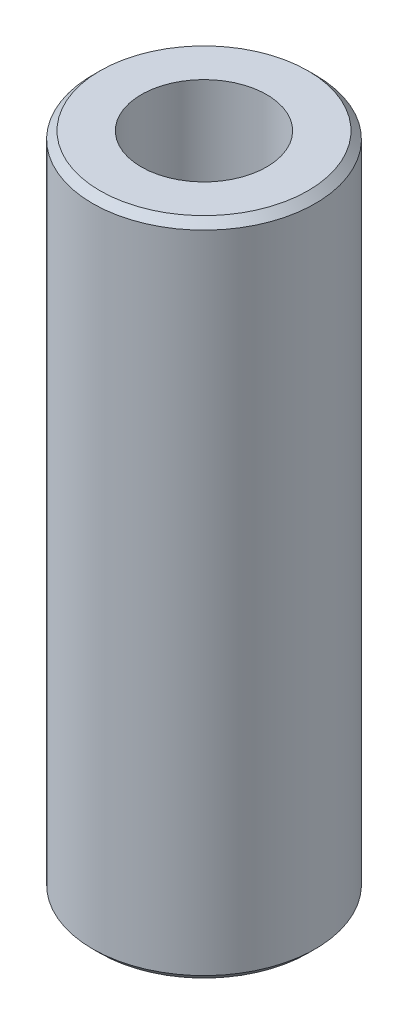
ISO-10303-21;
HEADER;
FILE_DESCRIPTION(('STEP AP214'),'2;1');
FILE_NAME('part.step','',(''),(''),'','','');
FILE_SCHEMA(('AUTOMOTIVE_DESIGN { 1 0 10303 214 1 1 1 1 }'));
ENDSEC;
DATA;
#1=APPLICATION_CONTEXT('core data for automotive mechanical design processes');
#2=APPLICATION_PROTOCOL_DEFINITION('international standard','automotive_design',2000,#1);
#3=PRODUCT_CONTEXT('',#1,'mechanical');
#4=PRODUCT('Part','Part','',(#3));
#5=PRODUCT_RELATED_PRODUCT_CATEGORY('part','',(#4));
#6=PRODUCT_DEFINITION_FORMATION('','',#4);
#7=PRODUCT_DEFINITION_CONTEXT('part definition',#1,'design');
#8=PRODUCT_DEFINITION('design','',#6,#7);
#9=PRODUCT_DEFINITION_SHAPE('','',#8);
#10=(LENGTH_UNIT() NAMED_UNIT(*) SI_UNIT(.MILLI.,.METRE.));
#11=(NAMED_UNIT(*) PLANE_ANGLE_UNIT() SI_UNIT($,.RADIAN.));
#12=(NAMED_UNIT(*) SI_UNIT($,.STERADIAN.) SOLID_ANGLE_UNIT());
#13=UNCERTAINTY_MEASURE_WITH_UNIT(LENGTH_MEASURE(1.E-05),#10,'distance_accuracy_value','');
#14=(GEOMETRIC_REPRESENTATION_CONTEXT(3) GLOBAL_UNCERTAINTY_ASSIGNED_CONTEXT((#13)) GLOBAL_UNIT_ASSIGNED_CONTEXT((#10,
#11,#12)) REPRESENTATION_CONTEXT('',''));
#15=CARTESIAN_POINT('',(0.,0.,0.));
#16=DIRECTION('',(0.,0.,1.));
#17=DIRECTION('',(1.,0.,0.));
#18=AXIS2_PLACEMENT_3D('',#15,#16,#17);
#19=CARTESIAN_POINT('',(0.,74.1376065641365,0.));
#20=DIRECTION('',(0.,-1.,0.));
#21=DIRECTION('',(0.,0.,-1.));
#22=AXIS2_PLACEMENT_3D('',#19,#20,#21);
#23=CYLINDRICAL_SURFACE('',#22,12.5);
#24=CARTESIAN_POINT('',(0.,73.3101387756651,0.));
#25=DIRECTION('',(0.,1.,0.));
#26=DIRECTION('',(0.,0.,1.));
#27=AXIS2_PLACEMENT_3D('',#24,#25,#26);
#28=CIRCLE('',#27,12.5);
#29=CARTESIAN_POINT('',(0.,73.3101387756651,-12.5));
#30=VERTEX_POINT('',#29);
#31=EDGE_CURVE('E50',#30,#30,#28,.F.);
#32=CARTESIAN_POINT('',(0.,0.827467788471425,0.));
#33=DIRECTION('',(0.,1.,0.));
#34=DIRECTION('',(0.,0.,1.));
#35=AXIS2_PLACEMENT_3D('',#32,#33,#34);
#36=CIRCLE('',#35,12.5);
#37=CARTESIAN_POINT('',(0.,0.827467788471425,-12.5));
#38=VERTEX_POINT('',#37);
#39=EDGE_CURVE('E51',#38,#38,#36,.T.);
#40=CARTESIAN_POINT('',(0.,73.3101387756651,-12.5));
#41=CARTESIAN_POINT('',(0.,72.5551109528818,-12.5));
#42=CARTESIAN_POINT('',(0.,71.8000831300985,-12.5));
#43=CARTESIAN_POINT('',(0.,70.290027484532,-12.5));
#44=CARTESIAN_POINT('',(0.,69.5349996617487,-12.5));
#45=CARTESIAN_POINT('',(0.,68.0249440161822,-12.5));
#46=CARTESIAN_POINT('',(0.,67.2699161933989,-12.5));
#47=CARTESIAN_POINT('',(0.,65.7598605478324,-12.5));
#48=CARTESIAN_POINT('',(0.,65.0048327250491,-12.5));
#49=CARTESIAN_POINT('',(0.,63.4947770794826,-12.5));
#50=CARTESIAN_POINT('',(0.,62.7397492566993,-12.5));
#51=CARTESIAN_POINT('',(0.,61.2296936111328,-12.5));
#52=CARTESIAN_POINT('',(0.,60.4746657883495,-12.5));
#53=CARTESIAN_POINT('',(0.,58.964610142783,-12.5));
#54=CARTESIAN_POINT('',(0.,58.2095823199997,-12.5));
#55=CARTESIAN_POINT('',(0.,56.6995266744332,-12.5));
#56=CARTESIAN_POINT('',(0.,55.9444988516499,-12.5));
#57=CARTESIAN_POINT('',(0.,54.4344432060834,-12.5));
#58=CARTESIAN_POINT('',(0.,53.6794153833001,-12.5));
#59=CARTESIAN_POINT('',(0.,52.1693597377336,-12.5));
#60=CARTESIAN_POINT('',(0.,51.4143319149503,-12.5));
#61=CARTESIAN_POINT('',(0.,49.9042762693838,-12.5));
#62=CARTESIAN_POINT('',(0.,49.1492484466005,-12.5));
#63=CARTESIAN_POINT('',(0.,47.639192801034,-12.5));
#64=CARTESIAN_POINT('',(0.,46.8841649782507,-12.5));
#65=CARTESIAN_POINT('',(0.,45.3741093326842,-12.5));
#66=CARTESIAN_POINT('',(0.,44.6190815099009,-12.5));
#67=CARTESIAN_POINT('',(0.,43.1090258643344,-12.5));
#68=CARTESIAN_POINT('',(0.,42.3539980415511,-12.5));
#69=CARTESIAN_POINT('',(0.,40.8439423959846,-12.5));
#70=CARTESIAN_POINT('',(0.,40.0889145732013,-12.5));
#71=CARTESIAN_POINT('',(0.,38.5788589276348,-12.5));
#72=CARTESIAN_POINT('',(0.,37.8238311048515,-12.5));
#73=CARTESIAN_POINT('',(0.,36.313775459285,-12.5));
#74=CARTESIAN_POINT('',(0.,35.5587476365017,-12.5));
#75=CARTESIAN_POINT('',(0.,34.0486919909352,-12.5));
#76=CARTESIAN_POINT('',(0.,33.2936641681519,-12.5));
#77=CARTESIAN_POINT('',(0.,31.7836085225854,-12.5));
#78=CARTESIAN_POINT('',(0.,31.0285806998021,-12.5));
#79=CARTESIAN_POINT('',(0.,29.5185250542356,-12.5));
#80=CARTESIAN_POINT('',(0.,28.7634972314523,-12.5));
#81=CARTESIAN_POINT('',(0.,27.2534415858858,-12.5));
#82=CARTESIAN_POINT('',(0.,26.4984137631025,-12.5));
#83=CARTESIAN_POINT('',(0.,24.988358117536,-12.5));
#84=CARTESIAN_POINT('',(0.,24.2333302947527,-12.5));
#85=CARTESIAN_POINT('',(0.,22.7232746491862,-12.5));
#86=CARTESIAN_POINT('',(0.,21.9682468264029,-12.5));
#87=CARTESIAN_POINT('',(0.,20.4581911808364,-12.5));
#88=CARTESIAN_POINT('',(0.,19.7031633580531,-12.5));
#89=CARTESIAN_POINT('',(0.,18.1931077124866,-12.5));
#90=CARTESIAN_POINT('',(0.,17.4380798897033,-12.5));
#91=CARTESIAN_POINT('',(0.,15.9280242441368,-12.5));
#92=CARTESIAN_POINT('',(0.,15.1729964213535,-12.5));
#93=CARTESIAN_POINT('',(0.,13.662940775787,-12.5));
#94=CARTESIAN_POINT('',(0.,12.9079129530037,-12.5));
#95=CARTESIAN_POINT('',(0.,11.3978573074372,-12.5));
#96=CARTESIAN_POINT('',(0.,10.6428294846539,-12.5));
#97=CARTESIAN_POINT('',(0.,9.13277383908737,-12.5));
#98=CARTESIAN_POINT('',(0.,8.37774601630411,-12.5));
#99=CARTESIAN_POINT('',(0.,6.86769037073757,-12.5));
#100=CARTESIAN_POINT('',(0.,6.1126625479543,-12.5));
#101=CARTESIAN_POINT('',(0.,4.60260690238777,-12.5));
#102=CARTESIAN_POINT('',(0.,3.8475790796045,-12.5));
#103=CARTESIAN_POINT('',(0.,2.33752343403796,-12.5));
#104=CARTESIAN_POINT('',(0.,1.58249561125469,-12.5));
#105=CARTESIAN_POINT('',(0.,0.827467788471425,-12.5));
#106=B_SPLINE_CURVE_WITH_KNOTS('',3,(#40,#41,#42,#43,#44,#45,#46,#47,#48,#49,#50,#51,#52,#53,
#54,#55,#56,#57,#58,#59,#60,#61,#62,#63,#64,#65,#66,#67,#68,#69,#70,#71,#72,#73,#74,#75,#76,#77,
#78,#79,#80,#81,#82,#83,#84,#85,#86,#87,#88,#89,#90,#91,#92,#93,#94,#95,#96,#97,#98,#99,#100,
#101,#102,#103,#104,#105),.UNSPECIFIED.,.F.,.F.,(4,2,2,2,2,2,2,2,2,2,2,2,2,2,2,2,2,2,2,2,2,2,2,
2,2,2,2,2,2,2,2,2,4),(0.,2.26508346834979,4.53016693669959,6.7952504050494,9.06033387339919,
11.325417341749,13.5905008100988,15.8555842784486,18.1206677467984,20.3857512151482,
22.650834683498,24.9159181518478,27.1810016201976,29.4460850885474,31.7111685568972,
33.976252025247,36.2413354935968,38.5064189619466,40.7715024302964,43.0365858986462,
45.301669366996,47.5667528353458,49.8318363036956,52.0969197720454,54.3620032403952,
56.627086708745,58.8921701770948,61.1572536454446,63.4223371137944,65.6874205821442,
67.952504050494,70.2175875188438,72.4826709871936),.UNSPECIFIED.);
#107=EDGE_CURVE('BSEAM39',#30,#38,#106,.T.);
#108=ORIENTED_EDGE('',*,*,#31,.T.);
#109=ORIENTED_EDGE('',*,*,#39,.T.);
#110=ORIENTED_EDGE('',*,*,#107,.T.);
#111=ORIENTED_EDGE('',*,*,#107,.F.);
#112=EDGE_LOOP('',(#108,#110,#109,#111));
#113=FACE_BOUND('',#112,.T.);
#114=ADVANCED_FACE('F39',(#113),#23,.T.);
#115=CARTESIAN_POINT('',(0.,74.1376065641365,0.));
#116=DIRECTION('',(0.,1.,0.));
#117=DIRECTION('',(0.,0.,1.));
#118=AXIS2_PLACEMENT_3D('',#115,#116,#117);
#119=PLANE('',#118);
#120=CARTESIAN_POINT('',(0.,74.1376065641365,0.));
#121=DIRECTION('',(0.,1.,0.));
#122=DIRECTION('',(0.,0.,1.));
#123=AXIS2_PLACEMENT_3D('',#120,#121,#122);
#124=CIRCLE('',#123,11.6725322115286);
#125=CARTESIAN_POINT('',(0.,74.1376065641365,-11.6725322115286));
#126=VERTEX_POINT('',#125);
#127=EDGE_CURVE('E54',#126,#126,#124,.T.);
#128=ORIENTED_EDGE('',*,*,#127,.T.);
#129=EDGE_LOOP('',(#128));
#130=FACE_BOUND('',#129,.T.);
#131=CARTESIAN_POINT('',(0.,74.1376065641365,0.));
#132=DIRECTION('',(0.,1.,0.));
#133=DIRECTION('',(0.,0.,1.));
#134=AXIS2_PLACEMENT_3D('',#131,#132,#133);
#135=CIRCLE('',#134,7.04064640572778);
#136=CARTESIAN_POINT('',(0.,74.1376065641365,7.04064640572778));
#137=VERTEX_POINT('',#136);
#138=EDGE_CURVE('E58',#137,#137,#135,.T.);
#139=ORIENTED_EDGE('',*,*,#138,.F.);
#140=EDGE_LOOP('',(#139));
#141=FACE_BOUND('',#140,.T.);
#142=ADVANCED_FACE('F69',(#130,#141),#119,.T.);
#143=CARTESIAN_POINT('',(0.,0.,0.));
#144=DIRECTION('',(0.,1.,0.));
#145=DIRECTION('',(0.,0.,1.));
#146=AXIS2_PLACEMENT_3D('',#143,#144,#145);
#147=PLANE('',#146);
#148=CARTESIAN_POINT('',(0.,0.,0.));
#149=DIRECTION('',(0.,1.,0.));
#150=DIRECTION('',(0.,0.,1.));
#151=AXIS2_PLACEMENT_3D('',#148,#149,#150);
#152=CIRCLE('',#151,11.6725322115286);
#153=CARTESIAN_POINT('',(0.,0.,11.6725322115286));
#154=VERTEX_POINT('',#153);
#155=EDGE_CURVE('E10',#154,#154,#152,.F.);
#156=ORIENTED_EDGE('',*,*,#155,.T.);
#157=EDGE_LOOP('',(#156));
#158=FACE_BOUND('',#157,.T.);
#159=CARTESIAN_POINT('',(0.,0.,0.));
#160=DIRECTION('',(0.,1.,0.));
#161=DIRECTION('',(0.,0.,1.));
#162=AXIS2_PLACEMENT_3D('',#159,#160,#161);
#163=CIRCLE('',#162,7.04064640572778);
#164=CARTESIAN_POINT('',(0.,0.,7.04064640572778));
#165=VERTEX_POINT('',#164);
#166=EDGE_CURVE('E63',#165,#165,#163,.T.);
#167=ORIENTED_EDGE('',*,*,#166,.T.);
#168=EDGE_LOOP('',(#167));
#169=FACE_BOUND('',#168,.T.);
#170=ADVANCED_FACE('F75',(#158,#169),#147,.F.);
#171=CARTESIAN_POINT('',(0.,74.1376065641365,0.));
#172=DIRECTION('',(0.,-1.,0.));
#173=DIRECTION('',(0.,0.,-1.));
#174=AXIS2_PLACEMENT_3D('',#171,#172,#173);
#175=CYLINDRICAL_SURFACE('',#174,7.04064640572778);
#176=ORIENTED_EDGE('',*,*,#138,.T.);
#177=EDGE_LOOP('',(#176));
#178=FACE_BOUND('',#177,.T.);
#179=ORIENTED_EDGE('',*,*,#166,.F.);
#180=EDGE_LOOP('',(#179));
#181=FACE_BOUND('',#180,.T.);
#182=ADVANCED_FACE('F70',(#178,#181),#175,.F.);
#183=CARTESIAN_POINT('',(0.,74.1376065641365,0.));
#184=DIRECTION('',(0.,-1.,0.));
#185=DIRECTION('',(0.,0.,-1.));
#186=AXIS2_PLACEMENT_3D('',#183,#184,#185);
#187=CONICAL_SURFACE('',#186,11.6725322115286,0.785398163397447);
#188=CARTESIAN_POINT('',(0.,73.3101387756651,-12.5));
#189=CARTESIAN_POINT('',(0.,73.318758231795,-12.4913805438701));
#190=CARTESIAN_POINT('',(0.,73.3273776879249,-12.4827610877402));
#191=CARTESIAN_POINT('',(0.,73.3446166001847,-12.4655221754804));
#192=CARTESIAN_POINT('',(0.,73.3532360563146,-12.4569027193505));
#193=CARTESIAN_POINT('',(0.,73.3704749685744,-12.4396638070906));
#194=CARTESIAN_POINT('',(0.,73.3790944247043,-12.4310443509607));
#195=CARTESIAN_POINT('',(0.,73.3963333369642,-12.4138054387009));
#196=CARTESIAN_POINT('',(0.,73.4049527930941,-12.405185982571));
#197=CARTESIAN_POINT('',(0.,73.4221917053539,-12.3879470703112));
#198=CARTESIAN_POINT('',(0.,73.4308111614838,-12.3793276141813));
#199=CARTESIAN_POINT('',(0.,73.4480500737436,-12.3620887019214));
#200=CARTESIAN_POINT('',(0.,73.4566695298736,-12.3534692457915));
#201=CARTESIAN_POINT('',(0.,73.4739084421334,-12.3362303335317));
#202=CARTESIAN_POINT('',(0.,73.4825278982633,-12.3276108774018));
#203=CARTESIAN_POINT('',(0.,73.4997668105231,-12.310371965142));
#204=CARTESIAN_POINT('',(0.,73.508386266653,-12.3017525090121));
#205=CARTESIAN_POINT('',(0.,73.5256251789128,-12.2845135967522));
#206=CARTESIAN_POINT('',(0.,73.5342446350427,-12.2758941406223));
#207=CARTESIAN_POINT('',(0.,73.5514835473026,-12.2586552283625));
#208=CARTESIAN_POINT('',(0.,73.5601030034325,-12.2500357722326));
#209=CARTESIAN_POINT('',(0.,73.5773419156923,-12.2327968599728));
#210=CARTESIAN_POINT('',(0.,73.5859613718222,-12.2241774038429));
#211=CARTESIAN_POINT('',(0.,73.603200284082,-12.206938491583));
#212=CARTESIAN_POINT('',(0.,73.6118197402119,-12.1983190354531));
#213=CARTESIAN_POINT('',(0.,73.6290586524718,-12.1810801231933));
#214=CARTESIAN_POINT('',(0.,73.6376781086017,-12.1724606670634));
#215=CARTESIAN_POINT('',(0.,73.6549170208615,-12.1552217548036));
#216=CARTESIAN_POINT('',(0.,73.6635364769914,-12.1466022986737));
#217=CARTESIAN_POINT('',(0.,73.6807753892512,-12.1293633864138));
#218=CARTESIAN_POINT('',(0.,73.6893948453811,-12.1207439302839));
#219=CARTESIAN_POINT('',(0.,73.706633757641,-12.1035050180241));
#220=CARTESIAN_POINT('',(0.,73.7152532137709,-12.0948855618942));
#221=CARTESIAN_POINT('',(0.,73.7324921260307,-12.0776466496344));
#222=CARTESIAN_POINT('',(0.,73.7411115821606,-12.0690271935045));
#223=CARTESIAN_POINT('',(0.,73.7583504944204,-12.0517882812446));
#224=CARTESIAN_POINT('',(0.,73.7669699505503,-12.0431688251147));
#225=CARTESIAN_POINT('',(0.,73.7842088628102,-12.0259299128549));
#226=CARTESIAN_POINT('',(0.,73.7928283189401,-12.017310456725));
#227=CARTESIAN_POINT('',(0.,73.8100672311999,-12.0000715444652));
#228=CARTESIAN_POINT('',(0.,73.8186866873298,-11.9914520883353));
#229=CARTESIAN_POINT('',(0.,73.8359255995896,-11.9742131760754));
#230=CARTESIAN_POINT('',(0.,73.8445450557195,-11.9655937199455));
#231=CARTESIAN_POINT('',(0.,73.8617839679794,-11.9483548076857));
#232=CARTESIAN_POINT('',(0.,73.8704034241093,-11.9397353515558));
#233=CARTESIAN_POINT('',(0.,73.8876423363691,-11.922496439296));
#234=CARTESIAN_POINT('',(0.,73.896261792499,-11.9138769831661));
#235=CARTESIAN_POINT('',(0.,73.9135007047588,-11.8966380709063));
#236=CARTESIAN_POINT('',(0.,73.9221201608887,-11.8880186147763));
#237=CARTESIAN_POINT('',(0.,73.9393590731486,-11.8707797025165));
#238=CARTESIAN_POINT('',(0.,73.9479785292785,-11.8621602463866));
#239=CARTESIAN_POINT('',(0.,73.9652174415383,-11.8449213341268));
#240=CARTESIAN_POINT('',(0.,73.9738368976682,-11.8363018779969));
#241=CARTESIAN_POINT('',(0.,73.991075809928,-11.8190629657371));
#242=CARTESIAN_POINT('',(0.,73.9996952660579,-11.8104435096071));
#243=CARTESIAN_POINT('',(0.,74.0169341783178,-11.7932045973473));
#244=CARTESIAN_POINT('',(0.,74.0255536344477,-11.7845851412174));
#245=CARTESIAN_POINT('',(0.,74.0427925467075,-11.7673462289576));
#246=CARTESIAN_POINT('',(0.,74.0514120028374,-11.7587267728277));
#247=CARTESIAN_POINT('',(0.,74.0686509150972,-11.7414878605679));
#248=CARTESIAN_POINT('',(0.,74.0772703712271,-11.7328684044379));
#249=CARTESIAN_POINT('',(0.,74.0945092834869,-11.7156294921781));
#250=CARTESIAN_POINT('',(0.,74.1031287396169,-11.7070100360482));
#251=CARTESIAN_POINT('',(0.,74.1203676518767,-11.6897711237884));
#252=CARTESIAN_POINT('',(0.,74.1289871080066,-11.6811516676585));
#253=CARTESIAN_POINT('',(0.,74.1376065641365,-11.6725322115286));
#254=B_SPLINE_CURVE_WITH_KNOTS('',3,(#188,#189,#190,#191,#192,#193,#194,#195,#196,#197,#198,
#199,#200,#201,#202,#203,#204,#205,#206,#207,#208,#209,#210,#211,#212,#213,#214,#215,#216,#217,
#218,#219,#220,#221,#222,#223,#224,#225,#226,#227,#228,#229,#230,#231,#232,#233,#234,#235,#236,
#237,#238,#239,#240,#241,#242,#243,#244,#245,#246,#247,#248,#249,#250,#251,#252,#253),
.UNSPECIFIED.,.F.,.F.,(4,2,2,2,2,2,2,2,2,2,2,2,2,2,2,2,2,2,2,2,2,2,2,2,2,2,2,2,2,2,2,2,4),(0.,
0.0365692552775939,0.0731385105551976,0.109707765832793,0.146277021110396,0.18284627638799,
0.219415531665594,0.255984786943189,0.292554042220793,0.329123297498387,0.36569255277599,
0.402261808053584,0.438831063331189,0.475400318608783,0.511969573886387,0.548538829163981,
0.585108084441586,0.621677339719189,0.658246594996783,0.694815850274387,0.731385105551981,
0.767954360829586,0.804523616107179,0.841092871384783,0.877662126662377,0.914231381939981,
0.950800637217576,0.987369892495179,1.02393914777277,1.06050840305038,1.09707765832797,
1.13364691360558,1.17021616888318),.UNSPECIFIED.);
#255=EDGE_CURVE('BSEAM81',#30,#126,#254,.T.);
#256=ORIENTED_EDGE('',*,*,#31,.F.);
#257=ORIENTED_EDGE('',*,*,#127,.F.);
#258=ORIENTED_EDGE('',*,*,#255,.T.);
#259=ORIENTED_EDGE('',*,*,#255,.F.);
#260=EDGE_LOOP('',(#256,#258,#257,#259));
#261=FACE_BOUND('',#260,.T.);
#262=ADVANCED_FACE('F81',(#261),#187,.T.);
#263=CARTESIAN_POINT('',(0.,0.827467788471425,0.));
#264=DIRECTION('',(0.,1.,0.));
#265=DIRECTION('',(0.,0.,1.));
#266=AXIS2_PLACEMENT_3D('',#263,#264,#265);
#267=CONICAL_SURFACE('',#266,12.5,0.785398163397454);
#268=ORIENTED_EDGE('',*,*,#155,.F.);
#269=EDGE_LOOP('',(#268));
#270=FACE_BOUND('',#269,.T.);
#271=ORIENTED_EDGE('',*,*,#39,.F.);
#272=EDGE_LOOP('',(#271));
#273=FACE_BOUND('',#272,.T.);
#274=ADVANCED_FACE('F45',(#270,#273),#267,.T.);
#275=CLOSED_SHELL('',(#114,#142,#170,#182,#262,#274));
#276=MANIFOLD_SOLID_BREP('B2',#275);
#277=ADVANCED_BREP_SHAPE_REPRESENTATION('',(#18,#276),#14);
#278=SHAPE_DEFINITION_REPRESENTATION(#9,#277);
ENDSEC;
END-ISO-10303-21;
